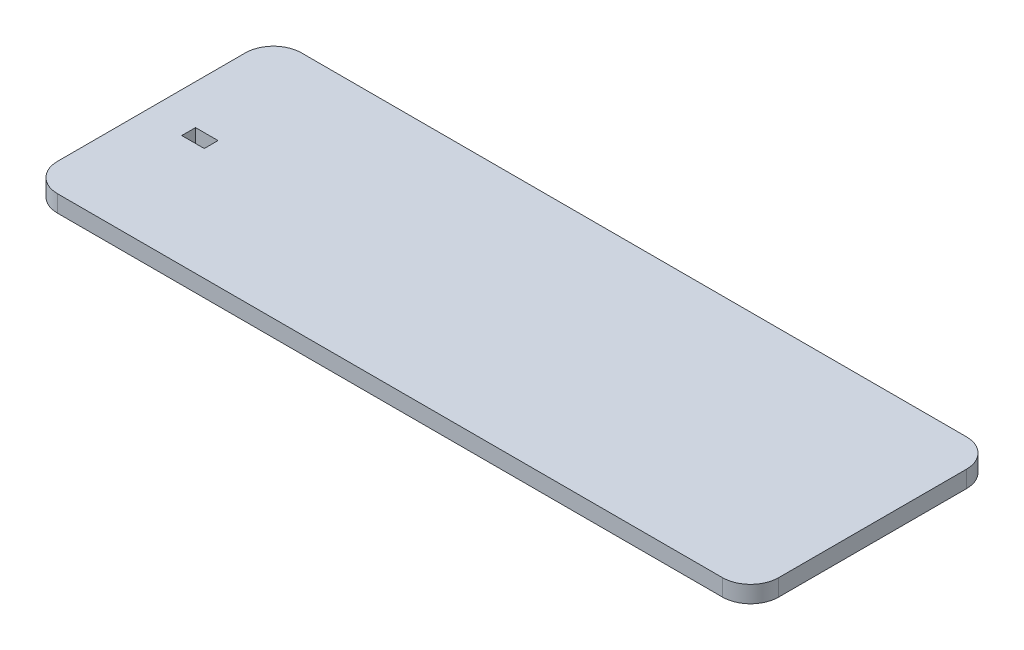
ISO-10303-21;
HEADER;
FILE_DESCRIPTION(('STEP AP214'),'2;1');
FILE_NAME('part.step','',(''),(''),'','','');
FILE_SCHEMA(('AUTOMOTIVE_DESIGN { 1 0 10303 214 1 1 1 1 }'));
ENDSEC;
DATA;
#1=APPLICATION_CONTEXT('core data for automotive mechanical design processes');
#2=APPLICATION_PROTOCOL_DEFINITION('international standard','automotive_design',2000,#1);
#3=PRODUCT_CONTEXT('',#1,'mechanical');
#4=PRODUCT('Part','Part','',(#3));
#5=PRODUCT_RELATED_PRODUCT_CATEGORY('part','',(#4));
#6=PRODUCT_DEFINITION_FORMATION('','',#4);
#7=PRODUCT_DEFINITION_CONTEXT('part definition',#1,'design');
#8=PRODUCT_DEFINITION('design','',#6,#7);
#9=PRODUCT_DEFINITION_SHAPE('','',#8);
#10=(LENGTH_UNIT() NAMED_UNIT(*) SI_UNIT(.MILLI.,.METRE.));
#11=(NAMED_UNIT(*) PLANE_ANGLE_UNIT() SI_UNIT($,.RADIAN.));
#12=(NAMED_UNIT(*) SI_UNIT($,.STERADIAN.) SOLID_ANGLE_UNIT());
#13=UNCERTAINTY_MEASURE_WITH_UNIT(LENGTH_MEASURE(1.E-05),#10,'distance_accuracy_value','');
#14=(GEOMETRIC_REPRESENTATION_CONTEXT(3) GLOBAL_UNCERTAINTY_ASSIGNED_CONTEXT((#13)) GLOBAL_UNIT_ASSIGNED_CONTEXT((#10,
#11,#12)) REPRESENTATION_CONTEXT('',''));
#15=CARTESIAN_POINT('',(0.,0.,0.));
#16=DIRECTION('',(0.,0.,1.));
#17=DIRECTION('',(1.,0.,0.));
#18=AXIS2_PLACEMENT_3D('',#15,#16,#17);
#19=CARTESIAN_POINT('',(35.2483988192163,6.,-35.0361602378579));
#20=DIRECTION('',(-1.,0.,0.));
#21=DIRECTION('',(0.,0.,1.));
#22=AXIS2_PLACEMENT_3D('',#19,#20,#21);
#23=PLANE('',#22);
#24=DIRECTION('',(0.,0.,-1.));
#25=VECTOR('',#24,1.);
#26=CARTESIAN_POINT('',(35.2483988192163,0.,-35.0361602378579));
#27=LINE('',#26,#25);
#28=CARTESIAN_POINT('',(35.2483988192163,0.,-45.0361602378579));
#29=VERTEX_POINT('',#28);
#30=CARTESIAN_POINT('',(35.2483988192163,0.,-111.80001656245));
#31=VERTEX_POINT('',#30);
#32=EDGE_CURVE('E153',#29,#31,#27,.T.);
#33=ORIENTED_EDGE('',*,*,#32,.T.);
#34=DIRECTION('',(0.,-1.,0.));
#35=VECTOR('',#34,1.);
#36=CARTESIAN_POINT('',(35.2483988192163,6.,-111.80001656245));
#37=LINE('',#36,#35);
#38=CARTESIAN_POINT('',(35.2483988192163,6.,-111.80001656245));
#39=VERTEX_POINT('',#38);
#40=EDGE_CURVE('E213',#31,#39,#37,.F.);
#41=ORIENTED_EDGE('',*,*,#40,.T.);
#42=DIRECTION('',(0.,0.,-1.));
#43=VECTOR('',#42,1.);
#44=CARTESIAN_POINT('',(35.2483988192163,6.,-35.0361602378579));
#45=LINE('',#44,#43);
#46=CARTESIAN_POINT('',(35.2483988192163,6.,-45.0361602378579));
#47=VERTEX_POINT('',#46);
#48=EDGE_CURVE('E158',#47,#39,#45,.T.);
#49=ORIENTED_EDGE('',*,*,#48,.F.);
#50=DIRECTION('',(0.,-1.,0.));
#51=VECTOR('',#50,1.);
#52=CARTESIAN_POINT('',(35.2483988192163,6.,-45.0361602378579));
#53=LINE('',#52,#51);
#54=EDGE_CURVE('E210',#47,#29,#53,.T.);
#55=ORIENTED_EDGE('',*,*,#54,.T.);
#56=EDGE_LOOP('',(#33,#41,#49,#55));
#57=FACE_BOUND('',#56,.T.);
#58=ADVANCED_FACE('F33',(#57),#23,.F.);
#59=CARTESIAN_POINT('',(-221.199113930992,6.,-121.80001656245));
#60=DIRECTION('',(0.,0.,1.));
#61=DIRECTION('',(1.,0.,0.));
#62=AXIS2_PLACEMENT_3D('',#59,#60,#61);
#63=PLANE('',#62);
#64=DIRECTION('',(-1.,0.,0.));
#65=VECTOR('',#64,1.);
#66=CARTESIAN_POINT('',(-221.199113930992,0.,-121.80001656245));
#67=LINE('',#66,#65);
#68=CARTESIAN_POINT('',(25.2483988192163,0.,-121.80001656245));
#69=VERTEX_POINT('',#68);
#70=CARTESIAN_POINT('',(-211.199113930992,0.,-121.80001656245));
#71=VERTEX_POINT('',#70);
#72=EDGE_CURVE('E172',#69,#71,#67,.T.);
#73=ORIENTED_EDGE('',*,*,#72,.T.);
#74=DIRECTION('',(0.,-1.,0.));
#75=VECTOR('',#74,1.);
#76=CARTESIAN_POINT('',(-211.199113930992,6.,-121.80001656245));
#77=LINE('',#76,#75);
#78=CARTESIAN_POINT('',(-211.199113930992,6.,-121.80001656245));
#79=VERTEX_POINT('',#78);
#80=EDGE_CURVE('E201',#71,#79,#77,.F.);
#81=ORIENTED_EDGE('',*,*,#80,.T.);
#82=DIRECTION('',(-1.,0.,0.));
#83=VECTOR('',#82,1.);
#84=CARTESIAN_POINT('',(-221.199113930992,6.,-121.80001656245));
#85=LINE('',#84,#83);
#86=CARTESIAN_POINT('',(25.2483988192163,6.,-121.80001656245));
#87=VERTEX_POINT('',#86);
#88=EDGE_CURVE('E161',#87,#79,#85,.T.);
#89=ORIENTED_EDGE('',*,*,#88,.F.);
#90=DIRECTION('',(0.,-1.,0.));
#91=VECTOR('',#90,1.);
#92=CARTESIAN_POINT('',(25.2483988192163,6.,-121.80001656245));
#93=LINE('',#92,#91);
#94=EDGE_CURVE('E198',#87,#69,#93,.T.);
#95=ORIENTED_EDGE('',*,*,#94,.T.);
#96=EDGE_LOOP('',(#73,#81,#89,#95));
#97=FACE_BOUND('',#96,.T.);
#98=ADVANCED_FACE('F237',(#97),#63,.F.);
#99=CARTESIAN_POINT('',(-221.199113930992,6.,-35.0361602378579));
#100=DIRECTION('',(1.,0.,0.));
#101=DIRECTION('',(0.,0.,-1.));
#102=AXIS2_PLACEMENT_3D('',#99,#100,#101);
#103=PLANE('',#102);
#104=DIRECTION('',(0.,0.,1.));
#105=VECTOR('',#104,1.);
#106=CARTESIAN_POINT('',(-221.199113930992,6.,-35.0361602378579));
#107=LINE('',#106,#105);
#108=CARTESIAN_POINT('',(-221.199113930992,6.,-111.80001656245));
#109=VERTEX_POINT('',#108);
#110=CARTESIAN_POINT('',(-221.199113930992,6.,-45.0361602378579));
#111=VERTEX_POINT('',#110);
#112=EDGE_CURVE('E165',#109,#111,#107,.T.);
#113=ORIENTED_EDGE('',*,*,#112,.F.);
#114=DIRECTION('',(0.,-1.,0.));
#115=VECTOR('',#114,1.);
#116=CARTESIAN_POINT('',(-221.199113930992,6.,-111.80001656245));
#117=LINE('',#116,#115);
#118=CARTESIAN_POINT('',(-221.199113930992,0.,-111.80001656245));
#119=VERTEX_POINT('',#118);
#120=EDGE_CURVE('E187',#109,#119,#117,.T.);
#121=ORIENTED_EDGE('',*,*,#120,.T.);
#122=DIRECTION('',(0.,0.,1.));
#123=VECTOR('',#122,1.);
#124=CARTESIAN_POINT('',(-221.199113930992,0.,-35.0361602378579));
#125=LINE('',#124,#123);
#126=CARTESIAN_POINT('',(-221.199113930992,0.,-45.0361602378579));
#127=VERTEX_POINT('',#126);
#128=EDGE_CURVE('E175',#119,#127,#125,.T.);
#129=ORIENTED_EDGE('',*,*,#128,.T.);
#130=DIRECTION('',(0.,-1.,0.));
#131=VECTOR('',#130,1.);
#132=CARTESIAN_POINT('',(-221.199113930992,6.,-45.0361602378579));
#133=LINE('',#132,#131);
#134=EDGE_CURVE('E185',#127,#111,#133,.F.);
#135=ORIENTED_EDGE('',*,*,#134,.T.);
#136=EDGE_LOOP('',(#113,#121,#129,#135));
#137=FACE_BOUND('',#136,.T.);
#138=ADVANCED_FACE('F245',(#137),#103,.F.);
#139=CARTESIAN_POINT('',(-221.199113930992,6.,-35.0361602378579));
#140=DIRECTION('',(0.,0.,-1.));
#141=DIRECTION('',(-1.,0.,0.));
#142=AXIS2_PLACEMENT_3D('',#139,#140,#141);
#143=PLANE('',#142);
#144=DIRECTION('',(1.,0.,0.));
#145=VECTOR('',#144,1.);
#146=CARTESIAN_POINT('',(-221.199113930992,0.,-35.0361602378579));
#147=LINE('',#146,#145);
#148=CARTESIAN_POINT('',(-211.199113930992,0.,-35.0361602378579));
#149=VERTEX_POINT('',#148);
#150=CARTESIAN_POINT('',(25.2483988192163,0.,-35.0361602378579));
#151=VERTEX_POINT('',#150);
#152=EDGE_CURVE('E162',#149,#151,#147,.T.);
#153=ORIENTED_EDGE('',*,*,#152,.T.);
#154=DIRECTION('',(0.,-1.,0.));
#155=VECTOR('',#154,1.);
#156=CARTESIAN_POINT('',(25.2483988192163,6.,-35.0361602378579));
#157=LINE('',#156,#155);
#158=CARTESIAN_POINT('',(25.2483988192163,6.,-35.0361602378579));
#159=VERTEX_POINT('',#158);
#160=EDGE_CURVE('E11',#151,#159,#157,.F.);
#161=ORIENTED_EDGE('',*,*,#160,.T.);
#162=DIRECTION('',(1.,0.,0.));
#163=VECTOR('',#162,1.);
#164=CARTESIAN_POINT('',(-221.199113930992,6.,-35.0361602378579));
#165=LINE('',#164,#163);
#166=CARTESIAN_POINT('',(-211.199113930992,6.,-35.0361602378579));
#167=VERTEX_POINT('',#166);
#168=EDGE_CURVE('E167',#167,#159,#165,.T.);
#169=ORIENTED_EDGE('',*,*,#168,.F.);
#170=DIRECTION('',(0.,-1.,0.));
#171=VECTOR('',#170,1.);
#172=CARTESIAN_POINT('',(-211.199113930992,6.,-35.0361602378579));
#173=LINE('',#172,#171);
#174=EDGE_CURVE('E41',#167,#149,#173,.T.);
#175=ORIENTED_EDGE('',*,*,#174,.T.);
#176=EDGE_LOOP('',(#153,#161,#169,#175));
#177=FACE_BOUND('',#176,.T.);
#178=ADVANCED_FACE('F217',(#177),#143,.F.);
#179=CARTESIAN_POINT('',(0.,6.,0.));
#180=DIRECTION('',(0.,-1.,0.));
#181=DIRECTION('',(0.,0.,-1.));
#182=AXIS2_PLACEMENT_3D('',#179,#180,#181);
#183=PLANE('',#182);
#184=DIRECTION('',(1.,0.,0.));
#185=VECTOR('',#184,1.);
#186=CARTESIAN_POINT('',(-207.05,6.,-79.95));
#187=LINE('',#186,#185);
#188=CARTESIAN_POINT('',(-207.05,6.,-79.95));
#189=VERTEX_POINT('',#188);
#190=CARTESIAN_POINT('',(-199.05,6.,-79.95));
#191=VERTEX_POINT('',#190);
#192=EDGE_CURVE('E134',#189,#191,#187,.T.);
#193=ORIENTED_EDGE('',*,*,#192,.T.);
#194=DIRECTION('',(0.,0.,1.));
#195=VECTOR('',#194,1.);
#196=CARTESIAN_POINT('',(-199.05,6.,-79.95));
#197=LINE('',#196,#195);
#198=CARTESIAN_POINT('',(-199.05,6.,-75.05));
#199=VERTEX_POINT('',#198);
#200=EDGE_CURVE('E127',#191,#199,#197,.T.);
#201=ORIENTED_EDGE('',*,*,#200,.T.);
#202=DIRECTION('',(-1.,0.,0.));
#203=VECTOR('',#202,1.);
#204=CARTESIAN_POINT('',(-207.05,6.,-75.05));
#205=LINE('',#204,#203);
#206=CARTESIAN_POINT('',(-207.05,6.,-75.05));
#207=VERTEX_POINT('',#206);
#208=EDGE_CURVE('E138',#199,#207,#205,.T.);
#209=ORIENTED_EDGE('',*,*,#208,.T.);
#210=DIRECTION('',(0.,0.,-1.));
#211=VECTOR('',#210,1.);
#212=CARTESIAN_POINT('',(-207.05,6.,-79.95));
#213=LINE('',#212,#211);
#214=EDGE_CURVE('E143',#207,#189,#213,.T.);
#215=ORIENTED_EDGE('',*,*,#214,.T.);
#216=EDGE_LOOP('',(#193,#201,#209,#215));
#217=FACE_BOUND('',#216,.T.);
#218=ORIENTED_EDGE('',*,*,#88,.T.);
#219=CARTESIAN_POINT('',(-211.199113930992,6.,-111.80001656245));
#220=DIRECTION('',(0.,-1.,0.));
#221=DIRECTION('',(0.,0.,-1.));
#222=AXIS2_PLACEMENT_3D('',#219,#220,#221);
#223=CIRCLE('',#222,10.);
#224=EDGE_CURVE('E208',#79,#109,#223,.F.);
#225=ORIENTED_EDGE('',*,*,#224,.T.);
#226=ORIENTED_EDGE('',*,*,#112,.T.);
#227=CARTESIAN_POINT('',(-211.199113930992,6.,-45.0361602378579));
#228=DIRECTION('',(0.,-1.,0.));
#229=DIRECTION('',(0.,0.,-1.));
#230=AXIS2_PLACEMENT_3D('',#227,#228,#229);
#231=CIRCLE('',#230,10.);
#232=EDGE_CURVE('E53',#111,#167,#231,.F.);
#233=ORIENTED_EDGE('',*,*,#232,.T.);
#234=ORIENTED_EDGE('',*,*,#168,.T.);
#235=CARTESIAN_POINT('',(25.2483988192163,6.,-45.0361602378579));
#236=DIRECTION('',(0.,-1.,0.));
#237=DIRECTION('',(0.,0.,-1.));
#238=AXIS2_PLACEMENT_3D('',#235,#236,#237);
#239=CIRCLE('',#238,10.);
#240=EDGE_CURVE('E204',#159,#47,#239,.F.);
#241=ORIENTED_EDGE('',*,*,#240,.T.);
#242=ORIENTED_EDGE('',*,*,#48,.T.);
#243=CARTESIAN_POINT('',(25.2483988192163,6.,-111.80001656245));
#244=DIRECTION('',(0.,-1.,0.));
#245=DIRECTION('',(0.,0.,-1.));
#246=AXIS2_PLACEMENT_3D('',#243,#244,#245);
#247=CIRCLE('',#246,10.);
#248=EDGE_CURVE('E206',#39,#87,#247,.F.);
#249=ORIENTED_EDGE('',*,*,#248,.T.);
#250=EDGE_LOOP('',(#218,#225,#226,#233,#234,#241,#242,#249));
#251=FACE_BOUND('',#250,.T.);
#252=ADVANCED_FACE('F145',(#217,#251),#183,.F.);
#253=CARTESIAN_POINT('',(0.,0.,0.));
#254=DIRECTION('',(0.,-1.,0.));
#255=DIRECTION('',(0.,0.,-1.));
#256=AXIS2_PLACEMENT_3D('',#253,#254,#255);
#257=PLANE('',#256);
#258=DIRECTION('',(0.,0.,1.));
#259=VECTOR('',#258,1.);
#260=CARTESIAN_POINT('',(-199.05,0.,0.));
#261=LINE('',#260,#259);
#262=CARTESIAN_POINT('',(-199.05,0.,-79.95));
#263=VERTEX_POINT('',#262);
#264=CARTESIAN_POINT('',(-199.05,0.,-75.05));
#265=VERTEX_POINT('',#264);
#266=EDGE_CURVE('E130',#263,#265,#261,.T.);
#267=ORIENTED_EDGE('',*,*,#266,.F.);
#268=DIRECTION('',(1.,0.,0.));
#269=VECTOR('',#268,1.);
#270=CARTESIAN_POINT('',(0.,0.,-79.95));
#271=LINE('',#270,#269);
#272=CARTESIAN_POINT('',(-207.05,0.,-79.95));
#273=VERTEX_POINT('',#272);
#274=EDGE_CURVE('E182',#273,#263,#271,.T.);
#275=ORIENTED_EDGE('',*,*,#274,.F.);
#276=DIRECTION('',(0.,0.,-1.));
#277=VECTOR('',#276,1.);
#278=CARTESIAN_POINT('',(-207.05,0.,0.));
#279=LINE('',#278,#277);
#280=CARTESIAN_POINT('',(-207.05,0.,-75.05));
#281=VERTEX_POINT('',#280);
#282=EDGE_CURVE('E180',#281,#273,#279,.T.);
#283=ORIENTED_EDGE('',*,*,#282,.F.);
#284=DIRECTION('',(-1.,0.,0.));
#285=VECTOR('',#284,1.);
#286=CARTESIAN_POINT('',(0.,0.,-75.05));
#287=LINE('',#286,#285);
#288=EDGE_CURVE('E169',#265,#281,#287,.T.);
#289=ORIENTED_EDGE('',*,*,#288,.F.);
#290=EDGE_LOOP('',(#267,#275,#283,#289));
#291=FACE_BOUND('',#290,.T.);
#292=ORIENTED_EDGE('',*,*,#128,.F.);
#293=CARTESIAN_POINT('',(-211.199113930992,0.,-111.80001656245));
#294=DIRECTION('',(0.,-1.,0.));
#295=DIRECTION('',(0.,0.,-1.));
#296=AXIS2_PLACEMENT_3D('',#293,#294,#295);
#297=CIRCLE('',#296,10.);
#298=EDGE_CURVE('E196',#119,#71,#297,.T.);
#299=ORIENTED_EDGE('',*,*,#298,.T.);
#300=ORIENTED_EDGE('',*,*,#72,.F.);
#301=CARTESIAN_POINT('',(25.2483988192163,0.,-111.80001656245));
#302=DIRECTION('',(0.,-1.,0.));
#303=DIRECTION('',(0.,0.,-1.));
#304=AXIS2_PLACEMENT_3D('',#301,#302,#303);
#305=CIRCLE('',#304,10.);
#306=EDGE_CURVE('E194',#69,#31,#305,.T.);
#307=ORIENTED_EDGE('',*,*,#306,.T.);
#308=ORIENTED_EDGE('',*,*,#32,.F.);
#309=CARTESIAN_POINT('',(25.2483988192163,0.,-45.0361602378579));
#310=DIRECTION('',(0.,-1.,0.));
#311=DIRECTION('',(0.,0.,-1.));
#312=AXIS2_PLACEMENT_3D('',#309,#310,#311);
#313=CIRCLE('',#312,10.);
#314=EDGE_CURVE('E192',#29,#151,#313,.T.);
#315=ORIENTED_EDGE('',*,*,#314,.T.);
#316=ORIENTED_EDGE('',*,*,#152,.F.);
#317=CARTESIAN_POINT('',(-211.199113930992,0.,-45.0361602378579));
#318=DIRECTION('',(0.,-1.,0.));
#319=DIRECTION('',(0.,0.,-1.));
#320=AXIS2_PLACEMENT_3D('',#317,#318,#319);
#321=CIRCLE('',#320,10.);
#322=EDGE_CURVE('E190',#149,#127,#321,.T.);
#323=ORIENTED_EDGE('',*,*,#322,.T.);
#324=EDGE_LOOP('',(#292,#299,#300,#307,#308,#315,#316,#323));
#325=FACE_BOUND('',#324,.T.);
#326=ADVANCED_FACE('F221',(#291,#325),#257,.T.);
#327=CARTESIAN_POINT('',(-199.05,6.,-79.95));
#328=DIRECTION('',(1.,0.,0.));
#329=DIRECTION('',(0.,0.,-1.));
#330=AXIS2_PLACEMENT_3D('',#327,#328,#329);
#331=PLANE('',#330);
#332=ORIENTED_EDGE('',*,*,#266,.T.);
#333=DIRECTION('',(0.,-1.,0.));
#334=VECTOR('',#333,1.);
#335=CARTESIAN_POINT('',(-199.05,6.,-75.05));
#336=LINE('',#335,#334);
#337=EDGE_CURVE('E122',#199,#265,#336,.T.);
#338=ORIENTED_EDGE('',*,*,#337,.F.);
#339=ORIENTED_EDGE('',*,*,#200,.F.);
#340=DIRECTION('',(0.,-1.,0.));
#341=VECTOR('',#340,1.);
#342=CARTESIAN_POINT('',(-199.05,6.,-79.95));
#343=LINE('',#342,#341);
#344=EDGE_CURVE('E151',#191,#263,#343,.T.);
#345=ORIENTED_EDGE('',*,*,#344,.T.);
#346=EDGE_LOOP('',(#332,#338,#339,#345));
#347=FACE_BOUND('',#346,.T.);
#348=ADVANCED_FACE('F124',(#347),#331,.F.);
#349=CARTESIAN_POINT('',(-207.05,6.,-79.95));
#350=DIRECTION('',(0.,0.,-1.));
#351=DIRECTION('',(-1.,0.,0.));
#352=AXIS2_PLACEMENT_3D('',#349,#350,#351);
#353=PLANE('',#352);
#354=ORIENTED_EDGE('',*,*,#274,.T.);
#355=ORIENTED_EDGE('',*,*,#344,.F.);
#356=ORIENTED_EDGE('',*,*,#192,.F.);
#357=DIRECTION('',(0.,-1.,0.));
#358=VECTOR('',#357,1.);
#359=CARTESIAN_POINT('',(-207.05,6.,-79.95));
#360=LINE('',#359,#358);
#361=EDGE_CURVE('E154',#189,#273,#360,.T.);
#362=ORIENTED_EDGE('',*,*,#361,.T.);
#363=EDGE_LOOP('',(#354,#355,#356,#362));
#364=FACE_BOUND('',#363,.T.);
#365=ADVANCED_FACE('F299',(#364),#353,.F.);
#366=CARTESIAN_POINT('',(-207.05,6.,-79.95));
#367=DIRECTION('',(-1.,0.,0.));
#368=DIRECTION('',(0.,0.,1.));
#369=AXIS2_PLACEMENT_3D('',#366,#367,#368);
#370=PLANE('',#369);
#371=ORIENTED_EDGE('',*,*,#282,.T.);
#372=ORIENTED_EDGE('',*,*,#361,.F.);
#373=ORIENTED_EDGE('',*,*,#214,.F.);
#374=DIRECTION('',(0.,-1.,0.));
#375=VECTOR('',#374,1.);
#376=CARTESIAN_POINT('',(-207.05,6.,-75.05));
#377=LINE('',#376,#375);
#378=EDGE_CURVE('E133',#207,#281,#377,.T.);
#379=ORIENTED_EDGE('',*,*,#378,.T.);
#380=EDGE_LOOP('',(#371,#372,#373,#379));
#381=FACE_BOUND('',#380,.T.);
#382=ADVANCED_FACE('F291',(#381),#370,.F.);
#383=CARTESIAN_POINT('',(-207.05,6.,-75.05));
#384=DIRECTION('',(0.,0.,1.));
#385=DIRECTION('',(1.,0.,0.));
#386=AXIS2_PLACEMENT_3D('',#383,#384,#385);
#387=PLANE('',#386);
#388=ORIENTED_EDGE('',*,*,#288,.T.);
#389=ORIENTED_EDGE('',*,*,#378,.F.);
#390=ORIENTED_EDGE('',*,*,#208,.F.);
#391=ORIENTED_EDGE('',*,*,#337,.T.);
#392=EDGE_LOOP('',(#388,#389,#390,#391));
#393=FACE_BOUND('',#392,.T.);
#394=ADVANCED_FACE('F139',(#393),#387,.F.);
#395=CARTESIAN_POINT('',(-211.199113930992,6.,-111.80001656245));
#396=DIRECTION('',(0.,-1.,0.));
#397=DIRECTION('',(0.,0.,-1.));
#398=AXIS2_PLACEMENT_3D('',#395,#396,#397);
#399=CYLINDRICAL_SURFACE('',#398,10.);
#400=ORIENTED_EDGE('',*,*,#224,.F.);
#401=ORIENTED_EDGE('',*,*,#80,.F.);
#402=ORIENTED_EDGE('',*,*,#298,.F.);
#403=ORIENTED_EDGE('',*,*,#120,.F.);
#404=EDGE_LOOP('',(#400,#401,#402,#403));
#405=FACE_BOUND('',#404,.T.);
#406=ADVANCED_FACE('F242',(#405),#399,.T.);
#407=CARTESIAN_POINT('',(25.2483988192163,6.,-111.80001656245));
#408=DIRECTION('',(0.,-1.,0.));
#409=DIRECTION('',(0.,0.,-1.));
#410=AXIS2_PLACEMENT_3D('',#407,#408,#409);
#411=CYLINDRICAL_SURFACE('',#410,10.);
#412=ORIENTED_EDGE('',*,*,#248,.F.);
#413=ORIENTED_EDGE('',*,*,#40,.F.);
#414=ORIENTED_EDGE('',*,*,#306,.F.);
#415=ORIENTED_EDGE('',*,*,#94,.F.);
#416=EDGE_LOOP('',(#412,#413,#414,#415));
#417=FACE_BOUND('',#416,.T.);
#418=ADVANCED_FACE('F234',(#417),#411,.T.);
#419=CARTESIAN_POINT('',(25.2483988192163,6.,-45.0361602378579));
#420=DIRECTION('',(0.,-1.,0.));
#421=DIRECTION('',(0.,0.,-1.));
#422=AXIS2_PLACEMENT_3D('',#419,#420,#421);
#423=CYLINDRICAL_SURFACE('',#422,10.);
#424=ORIENTED_EDGE('',*,*,#240,.F.);
#425=ORIENTED_EDGE('',*,*,#160,.F.);
#426=ORIENTED_EDGE('',*,*,#314,.F.);
#427=ORIENTED_EDGE('',*,*,#54,.F.);
#428=EDGE_LOOP('',(#424,#425,#426,#427));
#429=FACE_BOUND('',#428,.T.);
#430=ADVANCED_FACE('F226',(#429),#423,.T.);
#431=CARTESIAN_POINT('',(-211.199113930992,6.,-45.0361602378579));
#432=DIRECTION('',(0.,-1.,0.));
#433=DIRECTION('',(0.,0.,-1.));
#434=AXIS2_PLACEMENT_3D('',#431,#432,#433);
#435=CYLINDRICAL_SURFACE('',#434,10.);
#436=ORIENTED_EDGE('',*,*,#232,.F.);
#437=ORIENTED_EDGE('',*,*,#134,.F.);
#438=ORIENTED_EDGE('',*,*,#322,.F.);
#439=ORIENTED_EDGE('',*,*,#174,.F.);
#440=EDGE_LOOP('',(#436,#437,#438,#439));
#441=FACE_BOUND('',#440,.T.);
#442=ADVANCED_FACE('F35',(#441),#435,.T.);
#443=CLOSED_SHELL('',(#58,#98,#138,#178,#252,#326,#348,#365,#382,#394,#406,#418,#430,#442));
#444=MANIFOLD_SOLID_BREP('B2',#443);
#445=ADVANCED_BREP_SHAPE_REPRESENTATION('',(#18,#444),#14);
#446=SHAPE_DEFINITION_REPRESENTATION(#9,#445);
ENDSEC;
END-ISO-10303-21;
